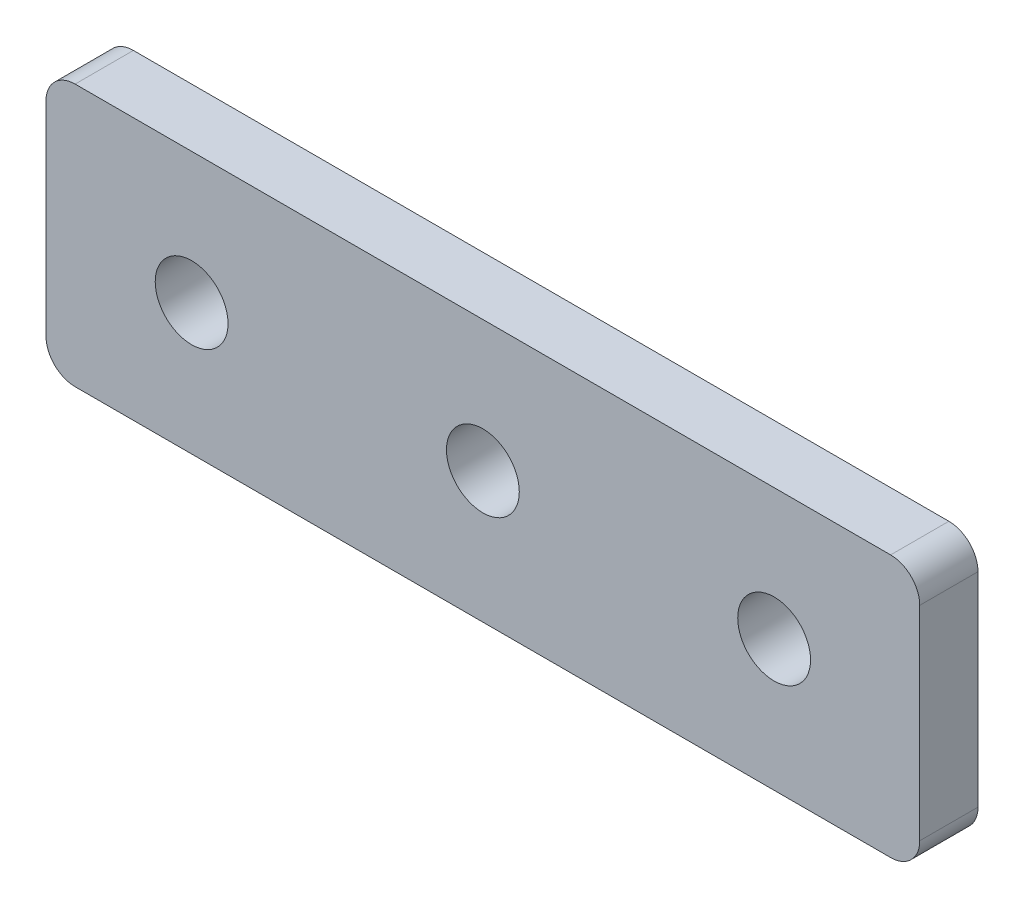
ISO-10303-21;
HEADER;
FILE_DESCRIPTION(('STEP AP214'),'2;1');
FILE_NAME('part.step','',(''),(''),'','','');
FILE_SCHEMA(('AUTOMOTIVE_DESIGN { 1 0 10303 214 1 1 1 1 }'));
ENDSEC;
DATA;
#1=APPLICATION_CONTEXT('core data for automotive mechanical design processes');
#2=APPLICATION_PROTOCOL_DEFINITION('international standard','automotive_design',2000,#1);
#3=PRODUCT_CONTEXT('',#1,'mechanical');
#4=PRODUCT('Part','Part','',(#3));
#5=PRODUCT_RELATED_PRODUCT_CATEGORY('part','',(#4));
#6=PRODUCT_DEFINITION_FORMATION('','',#4);
#7=PRODUCT_DEFINITION_CONTEXT('part definition',#1,'design');
#8=PRODUCT_DEFINITION('design','',#6,#7);
#9=PRODUCT_DEFINITION_SHAPE('','',#8);
#10=(LENGTH_UNIT() NAMED_UNIT(*) SI_UNIT(.MILLI.,.METRE.));
#11=(NAMED_UNIT(*) PLANE_ANGLE_UNIT() SI_UNIT($,.RADIAN.));
#12=(NAMED_UNIT(*) SI_UNIT($,.STERADIAN.) SOLID_ANGLE_UNIT());
#13=UNCERTAINTY_MEASURE_WITH_UNIT(LENGTH_MEASURE(1.E-05),#10,'distance_accuracy_value','');
#14=(GEOMETRIC_REPRESENTATION_CONTEXT(3) GLOBAL_UNCERTAINTY_ASSIGNED_CONTEXT((#13)) GLOBAL_UNIT_ASSIGNED_CONTEXT((#10,
#11,#12)) REPRESENTATION_CONTEXT('',''));
#15=CARTESIAN_POINT('',(0.,0.,0.));
#16=DIRECTION('',(0.,0.,1.));
#17=DIRECTION('',(1.,0.,0.));
#18=AXIS2_PLACEMENT_3D('',#15,#16,#17);
#19=CARTESIAN_POINT('',(28.438185392331,-6.07537372273691,0.637663625572713));
#20=DIRECTION('',(-1.,0.,0.));
#21=DIRECTION('',(0.,0.,1.));
#22=AXIS2_PLACEMENT_3D('',#19,#20,#21);
#23=PLANE('',#22);
#24=DIRECTION('',(0.,1.,0.));
#25=VECTOR('',#24,1.);
#26=CARTESIAN_POINT('',(28.438185392331,-6.07537372273691,-3.36233637442729));
#27=LINE('',#26,#25);
#28=CARTESIAN_POINT('',(28.438185392331,-4.07537372273691,-3.36233637442729));
#29=VERTEX_POINT('',#28);
#30=CARTESIAN_POINT('',(28.438185392331,9.92462627726309,-3.36233637442729));
#31=VERTEX_POINT('',#30);
#32=EDGE_CURVE('E109',#29,#31,#27,.T.);
#33=ORIENTED_EDGE('',*,*,#32,.T.);
#34=DIRECTION('',(0.,0.,-1.));
#35=VECTOR('',#34,1.);
#36=CARTESIAN_POINT('',(28.438185392331,9.92462627726309,0.637663625572713));
#37=LINE('',#36,#35);
#38=CARTESIAN_POINT('',(28.438185392331,9.92462627726309,0.637663625572713));
#39=VERTEX_POINT('',#38);
#40=EDGE_CURVE('E87',#31,#39,#37,.F.);
#41=ORIENTED_EDGE('',*,*,#40,.T.);
#42=DIRECTION('',(0.,1.,0.));
#43=VECTOR('',#42,1.);
#44=CARTESIAN_POINT('',(28.438185392331,-6.07537372273691,0.637663625572713));
#45=LINE('',#44,#43);
#46=CARTESIAN_POINT('',(28.438185392331,-4.07537372273691,0.637663625572713));
#47=VERTEX_POINT('',#46);
#48=EDGE_CURVE('E119',#47,#39,#45,.T.);
#49=ORIENTED_EDGE('',*,*,#48,.F.);
#50=DIRECTION('',(0.,0.,-1.));
#51=VECTOR('',#50,1.);
#52=CARTESIAN_POINT('',(28.438185392331,-4.07537372273691,0.637663625572713));
#53=LINE('',#52,#51);
#54=EDGE_CURVE('E92',#47,#29,#53,.T.);
#55=ORIENTED_EDGE('',*,*,#54,.T.);
#56=EDGE_LOOP('',(#33,#41,#49,#55));
#57=FACE_BOUND('',#56,.T.);
#58=ADVANCED_FACE('F16',(#57),#23,.F.);
#59=CARTESIAN_POINT('',(-31.561814607669,11.9246262772631,0.637663625572713));
#60=DIRECTION('',(0.,-1.,0.));
#61=DIRECTION('',(0.,0.,-1.));
#62=AXIS2_PLACEMENT_3D('',#59,#60,#61);
#63=PLANE('',#62);
#64=DIRECTION('',(-1.,0.,0.));
#65=VECTOR('',#64,1.);
#66=CARTESIAN_POINT('',(-31.561814607669,11.9246262772631,0.637663625572713));
#67=LINE('',#66,#65);
#68=CARTESIAN_POINT('',(26.438185392331,11.9246262772631,0.637663625572713));
#69=VERTEX_POINT('',#68);
#70=CARTESIAN_POINT('',(-29.561814607669,11.9246262772631,0.637663625572713));
#71=VERTEX_POINT('',#70);
#72=EDGE_CURVE('E102',#69,#71,#67,.T.);
#73=ORIENTED_EDGE('',*,*,#72,.F.);
#74=DIRECTION('',(0.,0.,-1.));
#75=VECTOR('',#74,1.);
#76=CARTESIAN_POINT('',(26.438185392331,11.9246262772631,0.637663625572713));
#77=LINE('',#76,#75);
#78=CARTESIAN_POINT('',(26.438185392331,11.9246262772631,-3.36233637442729));
#79=VERTEX_POINT('',#78);
#80=EDGE_CURVE('E86',#69,#79,#77,.T.);
#81=ORIENTED_EDGE('',*,*,#80,.T.);
#82=DIRECTION('',(-1.,0.,0.));
#83=VECTOR('',#82,1.);
#84=CARTESIAN_POINT('',(-31.561814607669,11.9246262772631,-3.36233637442729));
#85=LINE('',#84,#83);
#86=CARTESIAN_POINT('',(-29.561814607669,11.9246262772631,-3.36233637442729));
#87=VERTEX_POINT('',#86);
#88=EDGE_CURVE('E99',#79,#87,#85,.T.);
#89=ORIENTED_EDGE('',*,*,#88,.T.);
#90=DIRECTION('',(0.,0.,-1.));
#91=VECTOR('',#90,1.);
#92=CARTESIAN_POINT('',(-29.561814607669,11.9246262772631,0.637663625572713));
#93=LINE('',#92,#91);
#94=EDGE_CURVE('E104',#87,#71,#93,.F.);
#95=ORIENTED_EDGE('',*,*,#94,.T.);
#96=EDGE_LOOP('',(#73,#81,#89,#95));
#97=FACE_BOUND('',#96,.T.);
#98=ADVANCED_FACE('F98',(#97),#63,.F.);
#99=CARTESIAN_POINT('',(-31.561814607669,-6.07537372273691,0.637663625572713));
#100=DIRECTION('',(1.,0.,0.));
#101=DIRECTION('',(0.,0.,-1.));
#102=AXIS2_PLACEMENT_3D('',#99,#100,#101);
#103=PLANE('',#102);
#104=DIRECTION('',(0.,-1.,0.));
#105=VECTOR('',#104,1.);
#106=CARTESIAN_POINT('',(-31.561814607669,-6.07537372273691,-3.36233637442729));
#107=LINE('',#106,#105);
#108=CARTESIAN_POINT('',(-31.561814607669,9.92462627726309,-3.36233637442729));
#109=VERTEX_POINT('',#108);
#110=CARTESIAN_POINT('',(-31.561814607669,-4.07537372273691,-3.36233637442729));
#111=VERTEX_POINT('',#110);
#112=EDGE_CURVE('E108',#109,#111,#107,.T.);
#113=ORIENTED_EDGE('',*,*,#112,.T.);
#114=DIRECTION('',(0.,0.,-1.));
#115=VECTOR('',#114,1.);
#116=CARTESIAN_POINT('',(-31.561814607669,-4.07537372273691,0.637663625572713));
#117=LINE('',#116,#115);
#118=CARTESIAN_POINT('',(-31.561814607669,-4.07537372273691,0.637663625572713));
#119=VERTEX_POINT('',#118);
#120=EDGE_CURVE('E10',#111,#119,#117,.F.);
#121=ORIENTED_EDGE('',*,*,#120,.T.);
#122=DIRECTION('',(0.,-1.,0.));
#123=VECTOR('',#122,1.);
#124=CARTESIAN_POINT('',(-31.561814607669,-6.07537372273691,0.637663625572713));
#125=LINE('',#124,#123);
#126=CARTESIAN_POINT('',(-31.561814607669,9.92462627726309,0.637663625572713));
#127=VERTEX_POINT('',#126);
#128=EDGE_CURVE('E145',#127,#119,#125,.T.);
#129=ORIENTED_EDGE('',*,*,#128,.F.);
#130=DIRECTION('',(0.,0.,-1.));
#131=VECTOR('',#130,1.);
#132=CARTESIAN_POINT('',(-31.561814607669,9.92462627726309,0.637663625572713));
#133=LINE('',#132,#131);
#134=EDGE_CURVE('E24',#127,#109,#133,.T.);
#135=ORIENTED_EDGE('',*,*,#134,.T.);
#136=EDGE_LOOP('',(#113,#121,#129,#135));
#137=FACE_BOUND('',#136,.T.);
#138=ADVANCED_FACE('F143',(#137),#103,.F.);
#139=CARTESIAN_POINT('',(-31.561814607669,-6.07537372273691,0.637663625572713));
#140=DIRECTION('',(0.,1.,0.));
#141=DIRECTION('',(0.,0.,1.));
#142=AXIS2_PLACEMENT_3D('',#139,#140,#141);
#143=PLANE('',#142);
#144=DIRECTION('',(1.,0.,0.));
#145=VECTOR('',#144,1.);
#146=CARTESIAN_POINT('',(-31.561814607669,-6.07537372273691,-3.36233637442729));
#147=LINE('',#146,#145);
#148=CARTESIAN_POINT('',(-29.561814607669,-6.07537372273691,-3.36233637442729));
#149=VERTEX_POINT('',#148);
#150=CARTESIAN_POINT('',(26.438185392331,-6.07537372273691,-3.36233637442729));
#151=VERTEX_POINT('',#150);
#152=EDGE_CURVE('E112',#149,#151,#147,.T.);
#153=ORIENTED_EDGE('',*,*,#152,.T.);
#154=DIRECTION('',(0.,0.,-1.));
#155=VECTOR('',#154,1.);
#156=CARTESIAN_POINT('',(26.438185392331,-6.07537372273691,0.637663625572713));
#157=LINE('',#156,#155);
#158=CARTESIAN_POINT('',(26.438185392331,-6.07537372273691,0.637663625572713));
#159=VERTEX_POINT('',#158);
#160=EDGE_CURVE('E31',#151,#159,#157,.F.);
#161=ORIENTED_EDGE('',*,*,#160,.T.);
#162=DIRECTION('',(1.,0.,0.));
#163=VECTOR('',#162,1.);
#164=CARTESIAN_POINT('',(-31.561814607669,-6.07537372273691,0.637663625572713));
#165=LINE('',#164,#163);
#166=CARTESIAN_POINT('',(-29.561814607669,-6.07537372273691,0.637663625572713));
#167=VERTEX_POINT('',#166);
#168=EDGE_CURVE('E120',#167,#159,#165,.T.);
#169=ORIENTED_EDGE('',*,*,#168,.F.);
#170=DIRECTION('',(0.,0.,-1.));
#171=VECTOR('',#170,1.);
#172=CARTESIAN_POINT('',(-29.561814607669,-6.07537372273691,0.637663625572713));
#173=LINE('',#172,#171);
#174=EDGE_CURVE('E136',#167,#149,#173,.T.);
#175=ORIENTED_EDGE('',*,*,#174,.T.);
#176=EDGE_LOOP('',(#153,#161,#169,#175));
#177=FACE_BOUND('',#176,.T.);
#178=ADVANCED_FACE('F152',(#177),#143,.F.);
#179=CARTESIAN_POINT('',(-1.56181460766902,2.92462627726309,0.637663625572713));
#180=DIRECTION('',(0.,0.,-1.));
#181=DIRECTION('',(-1.,0.,0.));
#182=AXIS2_PLACEMENT_3D('',#179,#180,#181);
#183=PLANE('',#182);
#184=CARTESIAN_POINT('',(-21.561814607669,2.92462627726308,0.637663625572713));
#185=DIRECTION('',(0.,0.,-1.));
#186=DIRECTION('',(-1.,0.,0.));
#187=AXIS2_PLACEMENT_3D('',#184,#185,#186);
#188=CIRCLE('',#187,2.5);
#189=CARTESIAN_POINT('',(-24.061814607669,2.92462627726308,0.637663625572713));
#190=VERTEX_POINT('',#189);
#191=EDGE_CURVE('E114',#190,#190,#188,.T.);
#192=ORIENTED_EDGE('',*,*,#191,.T.);
#193=EDGE_LOOP('',(#192));
#194=FACE_BOUND('',#193,.T.);
#195=CARTESIAN_POINT('',(18.438185392331,2.92462627726309,0.637663625572713));
#196=DIRECTION('',(0.,0.,-1.));
#197=DIRECTION('',(-1.,0.,0.));
#198=AXIS2_PLACEMENT_3D('',#195,#196,#197);
#199=CIRCLE('',#198,2.5);
#200=CARTESIAN_POINT('',(15.938185392331,2.92462627726309,0.637663625572713));
#201=VERTEX_POINT('',#200);
#202=EDGE_CURVE('E161',#201,#201,#199,.T.);
#203=ORIENTED_EDGE('',*,*,#202,.T.);
#204=EDGE_LOOP('',(#203));
#205=FACE_BOUND('',#204,.T.);
#206=CARTESIAN_POINT('',(-1.56181460766902,2.92462627726309,0.637663625572713));
#207=DIRECTION('',(0.,0.,-1.));
#208=DIRECTION('',(-1.,0.,0.));
#209=AXIS2_PLACEMENT_3D('',#206,#207,#208);
#210=CIRCLE('',#209,2.5);
#211=CARTESIAN_POINT('',(-4.06181460766902,2.92462627726309,0.637663625572713));
#212=VERTEX_POINT('',#211);
#213=EDGE_CURVE('E164',#212,#212,#210,.T.);
#214=ORIENTED_EDGE('',*,*,#213,.T.);
#215=EDGE_LOOP('',(#214));
#216=FACE_BOUND('',#215,.T.);
#217=ORIENTED_EDGE('',*,*,#48,.T.);
#218=CARTESIAN_POINT('',(26.438185392331,9.92462627726309,0.637663625572713));
#219=DIRECTION('',(0.,0.,-1.));
#220=DIRECTION('',(-1.,0.,0.));
#221=AXIS2_PLACEMENT_3D('',#218,#219,#220);
#222=CIRCLE('',#221,2.);
#223=EDGE_CURVE('E134',#39,#69,#222,.F.);
#224=ORIENTED_EDGE('',*,*,#223,.T.);
#225=ORIENTED_EDGE('',*,*,#72,.T.);
#226=CARTESIAN_POINT('',(-29.561814607669,9.92462627726309,0.637663625572713));
#227=DIRECTION('',(0.,0.,-1.));
#228=DIRECTION('',(-1.,0.,0.));
#229=AXIS2_PLACEMENT_3D('',#226,#227,#228);
#230=CIRCLE('',#229,2.);
#231=EDGE_CURVE('E129',#71,#127,#230,.F.);
#232=ORIENTED_EDGE('',*,*,#231,.T.);
#233=ORIENTED_EDGE('',*,*,#128,.T.);
#234=CARTESIAN_POINT('',(-29.561814607669,-4.07537372273691,0.637663625572713));
#235=DIRECTION('',(0.,0.,-1.));
#236=DIRECTION('',(-1.,0.,0.));
#237=AXIS2_PLACEMENT_3D('',#234,#235,#236);
#238=CIRCLE('',#237,2.);
#239=EDGE_CURVE('E38',#119,#167,#238,.F.);
#240=ORIENTED_EDGE('',*,*,#239,.T.);
#241=ORIENTED_EDGE('',*,*,#168,.T.);
#242=CARTESIAN_POINT('',(26.438185392331,-4.07537372273691,0.637663625572713));
#243=DIRECTION('',(0.,0.,-1.));
#244=DIRECTION('',(-1.,0.,0.));
#245=AXIS2_PLACEMENT_3D('',#242,#243,#244);
#246=CIRCLE('',#245,2.);
#247=EDGE_CURVE('E132',#159,#47,#246,.F.);
#248=ORIENTED_EDGE('',*,*,#247,.T.);
#249=EDGE_LOOP('',(#217,#224,#225,#232,#233,#240,#241,#248));
#250=FACE_BOUND('',#249,.T.);
#251=ADVANCED_FACE('F186',(#194,#205,#216,#250),#183,.F.);
#252=CARTESIAN_POINT('',(-1.56181460766902,2.92462627726309,-3.36233637442729));
#253=DIRECTION('',(0.,0.,-1.));
#254=DIRECTION('',(-1.,0.,0.));
#255=AXIS2_PLACEMENT_3D('',#252,#253,#254);
#256=PLANE('',#255);
#257=CARTESIAN_POINT('',(-21.561814607669,2.92462627726308,-3.36233637442729));
#258=DIRECTION('',(0.,0.,1.));
#259=DIRECTION('',(1.,0.,0.));
#260=AXIS2_PLACEMENT_3D('',#257,#258,#259);
#261=CIRCLE('',#260,2.5);
#262=CARTESIAN_POINT('',(-19.061814607669,2.92462627726308,-3.36233637442729));
#263=VERTEX_POINT('',#262);
#264=EDGE_CURVE('E167',#263,#263,#261,.T.);
#265=ORIENTED_EDGE('',*,*,#264,.T.);
#266=EDGE_LOOP('',(#265));
#267=FACE_BOUND('',#266,.T.);
#268=CARTESIAN_POINT('',(18.438185392331,2.92462627726309,-3.36233637442729));
#269=DIRECTION('',(0.,0.,1.));
#270=DIRECTION('',(1.,0.,0.));
#271=AXIS2_PLACEMENT_3D('',#268,#269,#270);
#272=CIRCLE('',#271,2.5);
#273=CARTESIAN_POINT('',(20.938185392331,2.92462627726309,-3.36233637442729));
#274=VERTEX_POINT('',#273);
#275=EDGE_CURVE('E171',#274,#274,#272,.T.);
#276=ORIENTED_EDGE('',*,*,#275,.T.);
#277=EDGE_LOOP('',(#276));
#278=FACE_BOUND('',#277,.T.);
#279=CARTESIAN_POINT('',(-1.56181460766902,2.92462627726309,-3.36233637442729));
#280=DIRECTION('',(0.,0.,1.));
#281=DIRECTION('',(1.,0.,0.));
#282=AXIS2_PLACEMENT_3D('',#279,#280,#281);
#283=CIRCLE('',#282,2.5);
#284=CARTESIAN_POINT('',(0.938185392330979,2.92462627726309,-3.36233637442729));
#285=VERTEX_POINT('',#284);
#286=EDGE_CURVE('E168',#285,#285,#283,.T.);
#287=ORIENTED_EDGE('',*,*,#286,.T.);
#288=EDGE_LOOP('',(#287));
#289=FACE_BOUND('',#288,.T.);
#290=ORIENTED_EDGE('',*,*,#88,.F.);
#291=CARTESIAN_POINT('',(26.438185392331,9.92462627726309,-3.36233637442729));
#292=DIRECTION('',(0.,0.,-1.));
#293=DIRECTION('',(-1.,0.,0.));
#294=AXIS2_PLACEMENT_3D('',#291,#292,#293);
#295=CIRCLE('',#294,2.);
#296=EDGE_CURVE('E82',#79,#31,#295,.T.);
#297=ORIENTED_EDGE('',*,*,#296,.T.);
#298=ORIENTED_EDGE('',*,*,#32,.F.);
#299=CARTESIAN_POINT('',(26.438185392331,-4.07537372273691,-3.36233637442729));
#300=DIRECTION('',(0.,0.,-1.));
#301=DIRECTION('',(-1.,0.,0.));
#302=AXIS2_PLACEMENT_3D('',#299,#300,#301);
#303=CIRCLE('',#302,2.);
#304=EDGE_CURVE('E93',#29,#151,#303,.T.);
#305=ORIENTED_EDGE('',*,*,#304,.T.);
#306=ORIENTED_EDGE('',*,*,#152,.F.);
#307=CARTESIAN_POINT('',(-29.561814607669,-4.07537372273691,-3.36233637442729));
#308=DIRECTION('',(0.,0.,-1.));
#309=DIRECTION('',(-1.,0.,0.));
#310=AXIS2_PLACEMENT_3D('',#307,#308,#309);
#311=CIRCLE('',#310,2.);
#312=EDGE_CURVE('E123',#149,#111,#311,.T.);
#313=ORIENTED_EDGE('',*,*,#312,.T.);
#314=ORIENTED_EDGE('',*,*,#112,.F.);
#315=CARTESIAN_POINT('',(-29.561814607669,9.92462627726309,-3.36233637442729));
#316=DIRECTION('',(0.,0.,-1.));
#317=DIRECTION('',(-1.,0.,0.));
#318=AXIS2_PLACEMENT_3D('',#315,#316,#317);
#319=CIRCLE('',#318,2.);
#320=EDGE_CURVE('E103',#109,#87,#319,.T.);
#321=ORIENTED_EDGE('',*,*,#320,.T.);
#322=EDGE_LOOP('',(#290,#297,#298,#305,#306,#313,#314,#321));
#323=FACE_BOUND('',#322,.T.);
#324=ADVANCED_FACE('F106',(#267,#278,#289,#323),#256,.T.);
#325=CARTESIAN_POINT('',(26.438185392331,9.92462627726309,0.637663625572713));
#326=DIRECTION('',(0.,0.,-1.));
#327=DIRECTION('',(-1.,0.,0.));
#328=AXIS2_PLACEMENT_3D('',#325,#326,#327);
#329=CYLINDRICAL_SURFACE('',#328,2.);
#330=ORIENTED_EDGE('',*,*,#223,.F.);
#331=ORIENTED_EDGE('',*,*,#40,.F.);
#332=ORIENTED_EDGE('',*,*,#296,.F.);
#333=ORIENTED_EDGE('',*,*,#80,.F.);
#334=EDGE_LOOP('',(#330,#331,#332,#333));
#335=FACE_BOUND('',#334,.T.);
#336=ADVANCED_FACE('F85',(#335),#329,.T.);
#337=CARTESIAN_POINT('',(26.438185392331,-4.07537372273691,0.637663625572713));
#338=DIRECTION('',(0.,0.,-1.));
#339=DIRECTION('',(-1.,0.,0.));
#340=AXIS2_PLACEMENT_3D('',#337,#338,#339);
#341=CYLINDRICAL_SURFACE('',#340,2.);
#342=ORIENTED_EDGE('',*,*,#247,.F.);
#343=ORIENTED_EDGE('',*,*,#160,.F.);
#344=ORIENTED_EDGE('',*,*,#304,.F.);
#345=ORIENTED_EDGE('',*,*,#54,.F.);
#346=EDGE_LOOP('',(#342,#343,#344,#345));
#347=FACE_BOUND('',#346,.T.);
#348=ADVANCED_FACE('F197',(#347),#341,.T.);
#349=CARTESIAN_POINT('',(-29.561814607669,-4.07537372273691,0.637663625572713));
#350=DIRECTION('',(0.,0.,-1.));
#351=DIRECTION('',(-1.,0.,0.));
#352=AXIS2_PLACEMENT_3D('',#349,#350,#351);
#353=CYLINDRICAL_SURFACE('',#352,2.);
#354=ORIENTED_EDGE('',*,*,#239,.F.);
#355=ORIENTED_EDGE('',*,*,#120,.F.);
#356=ORIENTED_EDGE('',*,*,#312,.F.);
#357=ORIENTED_EDGE('',*,*,#174,.F.);
#358=EDGE_LOOP('',(#354,#355,#356,#357));
#359=FACE_BOUND('',#358,.T.);
#360=ADVANCED_FACE('F151',(#359),#353,.T.);
#361=CARTESIAN_POINT('',(-29.561814607669,9.92462627726309,0.637663625572713));
#362=DIRECTION('',(0.,0.,-1.));
#363=DIRECTION('',(-1.,0.,0.));
#364=AXIS2_PLACEMENT_3D('',#361,#362,#363);
#365=CYLINDRICAL_SURFACE('',#364,2.);
#366=ORIENTED_EDGE('',*,*,#231,.F.);
#367=ORIENTED_EDGE('',*,*,#94,.F.);
#368=ORIENTED_EDGE('',*,*,#320,.F.);
#369=ORIENTED_EDGE('',*,*,#134,.F.);
#370=EDGE_LOOP('',(#366,#367,#368,#369));
#371=FACE_BOUND('',#370,.T.);
#372=ADVANCED_FACE('F18',(#371),#365,.T.);
#373=CARTESIAN_POINT('',(-1.56181460766902,2.92462627726309,-3.36233637442729));
#374=DIRECTION('',(0.,0.,1.));
#375=DIRECTION('',(1.,0.,0.));
#376=AXIS2_PLACEMENT_3D('',#373,#374,#375);
#377=CYLINDRICAL_SURFACE('',#376,2.5);
#378=ORIENTED_EDGE('',*,*,#286,.F.);
#379=EDGE_LOOP('',(#378));
#380=FACE_BOUND('',#379,.T.);
#381=ORIENTED_EDGE('',*,*,#213,.F.);
#382=EDGE_LOOP('',(#381));
#383=FACE_BOUND('',#382,.T.);
#384=ADVANCED_FACE('F219',(#380,#383),#377,.F.);
#385=CARTESIAN_POINT('',(18.438185392331,2.92462627726309,-3.36233637442729));
#386=DIRECTION('',(0.,0.,1.));
#387=DIRECTION('',(1.,0.,0.));
#388=AXIS2_PLACEMENT_3D('',#385,#386,#387);
#389=CYLINDRICAL_SURFACE('',#388,2.5);
#390=ORIENTED_EDGE('',*,*,#275,.F.);
#391=EDGE_LOOP('',(#390));
#392=FACE_BOUND('',#391,.T.);
#393=ORIENTED_EDGE('',*,*,#202,.F.);
#394=EDGE_LOOP('',(#393));
#395=FACE_BOUND('',#394,.T.);
#396=ADVANCED_FACE('F182',(#392,#395),#389,.F.);
#397=CARTESIAN_POINT('',(-21.561814607669,2.92462627726308,-3.36233637442729));
#398=DIRECTION('',(0.,0.,1.));
#399=DIRECTION('',(1.,0.,0.));
#400=AXIS2_PLACEMENT_3D('',#397,#398,#399);
#401=CYLINDRICAL_SURFACE('',#400,2.5);
#402=ORIENTED_EDGE('',*,*,#264,.F.);
#403=EDGE_LOOP('',(#402));
#404=FACE_BOUND('',#403,.T.);
#405=ORIENTED_EDGE('',*,*,#191,.F.);
#406=EDGE_LOOP('',(#405));
#407=FACE_BOUND('',#406,.T.);
#408=ADVANCED_FACE('F179',(#404,#407),#401,.F.);
#409=CLOSED_SHELL('',(#58,#98,#138,#178,#251,#324,#336,#348,#360,#372,#384,#396,#408));
#410=MANIFOLD_SOLID_BREP('B1',#409);
#411=ADVANCED_BREP_SHAPE_REPRESENTATION('',(#18,#410),#14);
#412=SHAPE_DEFINITION_REPRESENTATION(#9,#411);
ENDSEC;
END-ISO-10303-21;
